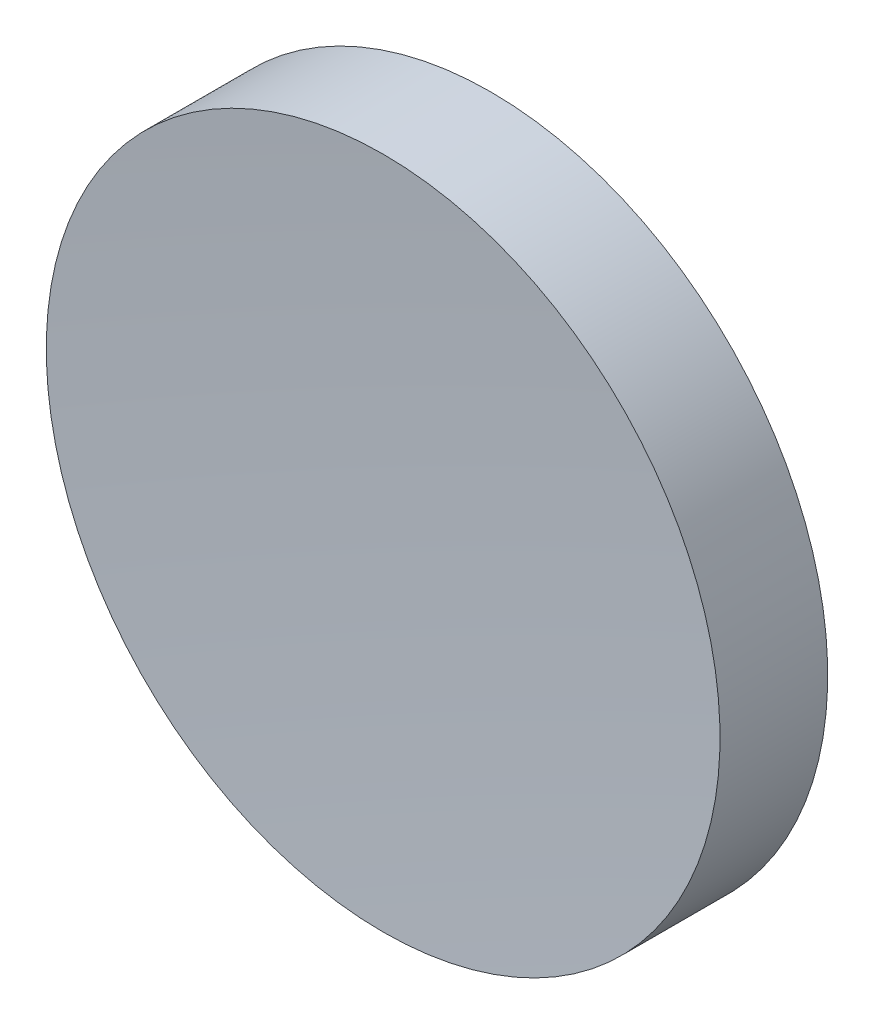
ISO-10303-21;
HEADER;
FILE_DESCRIPTION(('STEP AP214'),'2;1');
FILE_NAME('part.step','',(''),(''),'','','');
FILE_SCHEMA(('AUTOMOTIVE_DESIGN { 1 0 10303 214 1 1 1 1 }'));
ENDSEC;
DATA;
#1=APPLICATION_CONTEXT('core data for automotive mechanical design processes');
#2=APPLICATION_PROTOCOL_DEFINITION('international standard','automotive_design',2000,#1);
#3=PRODUCT_CONTEXT('',#1,'mechanical');
#4=PRODUCT('Part','Part','',(#3));
#5=PRODUCT_RELATED_PRODUCT_CATEGORY('part','',(#4));
#6=PRODUCT_DEFINITION_FORMATION('','',#4);
#7=PRODUCT_DEFINITION_CONTEXT('part definition',#1,'design');
#8=PRODUCT_DEFINITION('design','',#6,#7);
#9=PRODUCT_DEFINITION_SHAPE('','',#8);
#10=(LENGTH_UNIT() NAMED_UNIT(*) SI_UNIT(.MILLI.,.METRE.));
#11=(NAMED_UNIT(*) PLANE_ANGLE_UNIT() SI_UNIT($,.RADIAN.));
#12=(NAMED_UNIT(*) SI_UNIT($,.STERADIAN.) SOLID_ANGLE_UNIT());
#13=UNCERTAINTY_MEASURE_WITH_UNIT(LENGTH_MEASURE(1.E-05),#10,'distance_accuracy_value','');
#14=(GEOMETRIC_REPRESENTATION_CONTEXT(3) GLOBAL_UNCERTAINTY_ASSIGNED_CONTEXT((#13)) GLOBAL_UNIT_ASSIGNED_CONTEXT((#10,
#11,#12)) REPRESENTATION_CONTEXT('',''));
#15=CARTESIAN_POINT('',(0.,0.,0.));
#16=DIRECTION('',(0.,0.,1.));
#17=DIRECTION('',(1.,0.,0.));
#18=AXIS2_PLACEMENT_3D('',#15,#16,#17);
#19=CARTESIAN_POINT('',(0.,0.,242.473));
#20=DIRECTION('',(0.,0.,1.));
#21=DIRECTION('',(0.,1.,0.));
#22=AXIS2_PLACEMENT_3D('',#19,#20,#21);
#23=SPHERICAL_SURFACE('',#22,240.473);
#24=CARTESIAN_POINT('',(0.,0.,2.3355940653976));
#25=DIRECTION('',(0.,0.,1.));
#26=DIRECTION('',(0.,-1.,0.));
#27=AXIS2_PLACEMENT_3D('',#24,#25,#26);
#28=CIRCLE('',#27,12.7);
#29=CARTESIAN_POINT('',(0.,-12.7,2.3355940653976));
#30=VERTEX_POINT('',#29);
#31=EDGE_CURVE('E36',#30,#30,#28,.T.);
#32=ORIENTED_EDGE('',*,*,#31,.T.);
#33=EDGE_LOOP('',(#32));
#34=FACE_BOUND('',#33,.T.);
#35=ADVANCED_FACE('F30',(#34),#23,.F.);
#36=CARTESIAN_POINT('',(0.,0.,291.048));
#37=DIRECTION('',(0.,0.,1.));
#38=DIRECTION('',(0.,-1.,0.));
#39=AXIS2_PLACEMENT_3D('',#36,#37,#38);
#40=SPHERICAL_SURFACE('',#39,293.048);
#41=CARTESIAN_POINT('',(0.,0.,-1.72467683989913));
#42=DIRECTION('',(0.,0.,1.));
#43=DIRECTION('',(0.,-1.,0.));
#44=AXIS2_PLACEMENT_3D('',#41,#42,#43);
#45=CIRCLE('',#44,12.7);
#46=CARTESIAN_POINT('',(0.,-12.7,-1.72467683989914));
#47=VERTEX_POINT('',#46);
#48=EDGE_CURVE('E10',#47,#47,#45,.T.);
#49=ORIENTED_EDGE('',*,*,#48,.F.);
#50=EDGE_LOOP('',(#49));
#51=FACE_BOUND('',#50,.T.);
#52=ADVANCED_FACE('F45',(#51),#40,.T.);
#53=CARTESIAN_POINT('',(0.,0.,2.));
#54=DIRECTION('',(0.,0.,1.));
#55=DIRECTION('',(0.,-1.,0.));
#56=AXIS2_PLACEMENT_3D('',#53,#54,#55);
#57=CYLINDRICAL_SURFACE('',#56,12.7);
#58=ORIENTED_EDGE('',*,*,#31,.F.);
#59=EDGE_LOOP('',(#58));
#60=FACE_BOUND('',#59,.T.);
#61=ORIENTED_EDGE('',*,*,#48,.T.);
#62=EDGE_LOOP('',(#61));
#63=FACE_BOUND('',#62,.T.);
#64=ADVANCED_FACE('F43',(#60,#63),#57,.T.);
#65=CLOSED_SHELL('',(#35,#52,#64));
#66=MANIFOLD_SOLID_BREP('B2',#65);
#67=ADVANCED_BREP_SHAPE_REPRESENTATION('',(#18,#66),#14);
#68=SHAPE_DEFINITION_REPRESENTATION(#9,#67);
ENDSEC;
END-ISO-10303-21;
